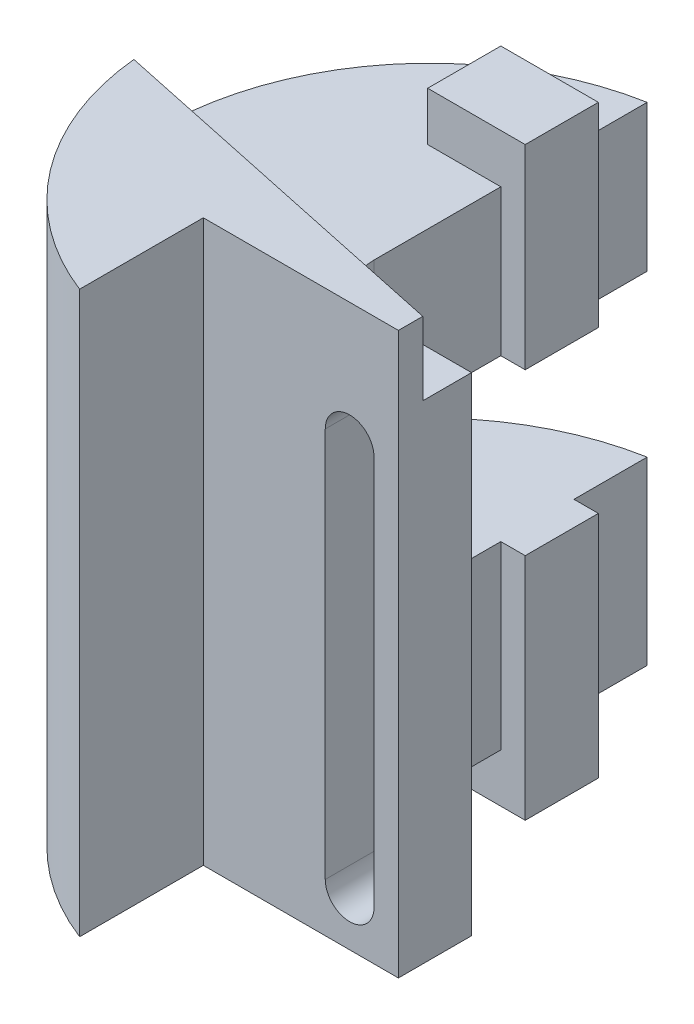
ISO-10303-21;
HEADER;
FILE_DESCRIPTION(('STEP AP214'),'2;1');
FILE_NAME('part.step','',(''),(''),'','','');
FILE_SCHEMA(('AUTOMOTIVE_DESIGN { 1 0 10303 214 1 1 1 1 }'));
ENDSEC;
DATA;
#1=APPLICATION_CONTEXT('core data for automotive mechanical design processes');
#2=APPLICATION_PROTOCOL_DEFINITION('international standard','automotive_design',2000,#1);
#3=PRODUCT_CONTEXT('',#1,'mechanical');
#4=PRODUCT('Part','Part','',(#3));
#5=PRODUCT_RELATED_PRODUCT_CATEGORY('part','',(#4));
#6=PRODUCT_DEFINITION_FORMATION('','',#4);
#7=PRODUCT_DEFINITION_CONTEXT('part definition',#1,'design');
#8=PRODUCT_DEFINITION('design','',#6,#7);
#9=PRODUCT_DEFINITION_SHAPE('','',#8);
#10=(LENGTH_UNIT() NAMED_UNIT(*) SI_UNIT(.MILLI.,.METRE.));
#11=(NAMED_UNIT(*) PLANE_ANGLE_UNIT() SI_UNIT($,.RADIAN.));
#12=(NAMED_UNIT(*) SI_UNIT($,.STERADIAN.) SOLID_ANGLE_UNIT());
#13=UNCERTAINTY_MEASURE_WITH_UNIT(LENGTH_MEASURE(1.E-05),#10,'distance_accuracy_value','');
#14=(GEOMETRIC_REPRESENTATION_CONTEXT(3) GLOBAL_UNCERTAINTY_ASSIGNED_CONTEXT((#13)) GLOBAL_UNIT_ASSIGNED_CONTEXT((#10,
#11,#12)) REPRESENTATION_CONTEXT('',''));
#15=CARTESIAN_POINT('',(0.,0.,0.));
#16=DIRECTION('',(0.,0.,1.));
#17=DIRECTION('',(1.,0.,0.));
#18=AXIS2_PLACEMENT_3D('',#15,#16,#17);
#19=CARTESIAN_POINT('',(-30.,100.,-25.));
#20=DIRECTION('',(-1.,0.,0.));
#21=DIRECTION('',(0.,0.,1.));
#22=AXIS2_PLACEMENT_3D('',#19,#20,#21);
#23=PLANE('',#22);
#24=DIRECTION('',(0.,-1.,0.));
#25=VECTOR('',#24,1.);
#26=CARTESIAN_POINT('',(-30.,100.,-81.));
#27=LINE('',#26,#25);
#28=CARTESIAN_POINT('',(-30.,37.,-81.));
#29=VERTEX_POINT('',#28);
#30=CARTESIAN_POINT('',(-30.,0.,-81.));
#31=VERTEX_POINT('',#30);
#32=EDGE_CURVE('E390',#29,#31,#27,.T.);
#33=ORIENTED_EDGE('',*,*,#32,.F.);
#34=DIRECTION('',(0.,0.,1.));
#35=VECTOR('',#34,1.);
#36=CARTESIAN_POINT('',(-30.,37.,-25.));
#37=LINE('',#36,#35);
#38=CARTESIAN_POINT('',(-30.,37.,-66.));
#39=VERTEX_POINT('',#38);
#40=EDGE_CURVE('E271',#29,#39,#37,.T.);
#41=ORIENTED_EDGE('',*,*,#40,.T.);
#42=DIRECTION('',(0.,1.,0.));
#43=VECTOR('',#42,1.);
#44=CARTESIAN_POINT('',(-30.,100.,-66.));
#45=LINE('',#44,#43);
#46=CARTESIAN_POINT('',(-30.,0.,-66.));
#47=VERTEX_POINT('',#46);
#48=EDGE_CURVE('E326',#47,#39,#45,.T.);
#49=ORIENTED_EDGE('',*,*,#48,.F.);
#50=DIRECTION('',(0.,0.,-1.));
#51=VECTOR('',#50,1.);
#52=CARTESIAN_POINT('',(-30.,0.,-25.));
#53=LINE('',#52,#51);
#54=EDGE_CURVE('E378',#47,#31,#53,.T.);
#55=ORIENTED_EDGE('',*,*,#54,.T.);
#56=EDGE_LOOP('',(#33,#41,#49,#55));
#57=FACE_BOUND('',#56,.T.);
#58=ADVANCED_FACE('F37',(#57),#23,.F.);
#59=CARTESIAN_POINT('',(-25.,110.,-66.));
#60=DIRECTION('',(-1.,0.,0.));
#61=DIRECTION('',(0.,0.,1.));
#62=AXIS2_PLACEMENT_3D('',#59,#60,#61);
#63=PLANE('',#62);
#64=DIRECTION('',(0.,-1.,0.));
#65=VECTOR('',#64,1.);
#66=CARTESIAN_POINT('',(-25.,110.,-66.));
#67=LINE('',#66,#65);
#68=CARTESIAN_POINT('',(-25.,37.,-66.));
#69=VERTEX_POINT('',#68);
#70=CARTESIAN_POINT('',(-25.,-9.99999999999999,-66.));
#71=VERTEX_POINT('',#70);
#72=EDGE_CURVE('E313',#69,#71,#67,.T.);
#73=ORIENTED_EDGE('',*,*,#72,.F.);
#74=DIRECTION('',(0.,0.,1.));
#75=VECTOR('',#74,1.);
#76=CARTESIAN_POINT('',(-25.,37.,-66.));
#77=LINE('',#76,#75);
#78=CARTESIAN_POINT('',(-25.,37.,-51.));
#79=VERTEX_POINT('',#78);
#80=EDGE_CURVE('E262',#69,#79,#77,.T.);
#81=ORIENTED_EDGE('',*,*,#80,.T.);
#82=DIRECTION('',(0.,-1.,0.));
#83=VECTOR('',#82,1.);
#84=CARTESIAN_POINT('',(-25.,110.,-51.));
#85=LINE('',#84,#83);
#86=CARTESIAN_POINT('',(-25.,-9.99999999999999,-51.));
#87=VERTEX_POINT('',#86);
#88=EDGE_CURVE('E291',#79,#87,#85,.T.);
#89=ORIENTED_EDGE('',*,*,#88,.T.);
#90=DIRECTION('',(0.,0.,-1.));
#91=VECTOR('',#90,1.);
#92=CARTESIAN_POINT('',(-25.,-9.99999999999999,-66.));
#93=LINE('',#92,#91);
#94=EDGE_CURVE('E280',#87,#71,#93,.T.);
#95=ORIENTED_EDGE('',*,*,#94,.T.);
#96=EDGE_LOOP('',(#73,#81,#89,#95));
#97=FACE_BOUND('',#96,.T.);
#98=ADVANCED_FACE('F451',(#97),#63,.F.);
#99=CARTESIAN_POINT('',(-25.,110.,-66.));
#100=DIRECTION('',(0.,0.,1.));
#101=DIRECTION('',(1.,0.,0.));
#102=AXIS2_PLACEMENT_3D('',#99,#100,#101);
#103=PLANE('',#102);
#104=ORIENTED_EDGE('',*,*,#48,.T.);
#105=DIRECTION('',(1.,0.,0.));
#106=VECTOR('',#105,1.);
#107=CARTESIAN_POINT('',(-25.,37.,-66.));
#108=LINE('',#107,#106);
#109=EDGE_CURVE('E268',#39,#69,#108,.T.);
#110=ORIENTED_EDGE('',*,*,#109,.T.);
#111=ORIENTED_EDGE('',*,*,#72,.T.);
#112=DIRECTION('',(-1.,0.,0.));
#113=VECTOR('',#112,1.);
#114=CARTESIAN_POINT('',(-25.,-9.99999999999999,-66.));
#115=LINE('',#114,#113);
#116=CARTESIAN_POINT('',(-45.,-9.99999999999999,-66.));
#117=VERTEX_POINT('',#116);
#118=EDGE_CURVE('E294',#71,#117,#115,.T.);
#119=ORIENTED_EDGE('',*,*,#118,.T.);
#120=DIRECTION('',(0.,-1.,0.));
#121=VECTOR('',#120,1.);
#122=CARTESIAN_POINT('',(-45.,110.,-66.));
#123=LINE('',#122,#121);
#124=CARTESIAN_POINT('',(-45.,0.,-66.));
#125=VERTEX_POINT('',#124);
#126=EDGE_CURVE('E309',#125,#117,#123,.T.);
#127=ORIENTED_EDGE('',*,*,#126,.F.);
#128=DIRECTION('',(1.,0.,0.));
#129=VECTOR('',#128,1.);
#130=CARTESIAN_POINT('',(-20.,0.,-66.));
#131=LINE('',#130,#129);
#132=EDGE_CURVE('E412',#125,#47,#131,.T.);
#133=ORIENTED_EDGE('',*,*,#132,.T.);
#134=EDGE_LOOP('',(#104,#110,#111,#119,#127,#133));
#135=FACE_BOUND('',#134,.T.);
#136=ADVANCED_FACE('F459',(#135),#103,.F.);
#137=CARTESIAN_POINT('',(-25.,110.,-51.));
#138=DIRECTION('',(0.,0.,-1.));
#139=DIRECTION('',(-1.,0.,0.));
#140=AXIS2_PLACEMENT_3D('',#137,#138,#139);
#141=PLANE('',#140);
#142=ORIENTED_EDGE('',*,*,#88,.F.);
#143=DIRECTION('',(-1.,0.,0.));
#144=VECTOR('',#143,1.);
#145=CARTESIAN_POINT('',(-25.,37.,-51.));
#146=LINE('',#145,#144);
#147=CARTESIAN_POINT('',(-30.,37.,-51.));
#148=VERTEX_POINT('',#147);
#149=EDGE_CURVE('E418',#79,#148,#146,.T.);
#150=ORIENTED_EDGE('',*,*,#149,.T.);
#151=DIRECTION('',(0.,-1.,0.));
#152=VECTOR('',#151,1.);
#153=CARTESIAN_POINT('',(-30.,100.,-51.));
#154=LINE('',#153,#152);
#155=CARTESIAN_POINT('',(-30.,0.,-51.));
#156=VERTEX_POINT('',#155);
#157=EDGE_CURVE('E317',#148,#156,#154,.T.);
#158=ORIENTED_EDGE('',*,*,#157,.T.);
#159=DIRECTION('',(-1.,0.,0.));
#160=VECTOR('',#159,1.);
#161=CARTESIAN_POINT('',(-20.,0.,-51.));
#162=LINE('',#161,#160);
#163=CARTESIAN_POINT('',(-45.,0.,-51.));
#164=VERTEX_POINT('',#163);
#165=EDGE_CURVE('E406',#156,#164,#162,.T.);
#166=ORIENTED_EDGE('',*,*,#165,.T.);
#167=DIRECTION('',(0.,-1.,0.));
#168=VECTOR('',#167,1.);
#169=CARTESIAN_POINT('',(-45.,110.,-51.));
#170=LINE('',#169,#168);
#171=CARTESIAN_POINT('',(-45.,-9.99999999999999,-51.));
#172=VERTEX_POINT('',#171);
#173=EDGE_CURVE('E305',#164,#172,#170,.T.);
#174=ORIENTED_EDGE('',*,*,#173,.T.);
#175=DIRECTION('',(1.,0.,0.));
#176=VECTOR('',#175,1.);
#177=CARTESIAN_POINT('',(-25.,-9.99999999999999,-51.));
#178=LINE('',#177,#176);
#179=EDGE_CURVE('E285',#172,#87,#178,.T.);
#180=ORIENTED_EDGE('',*,*,#179,.T.);
#181=EDGE_LOOP('',(#142,#150,#158,#166,#174,#180));
#182=FACE_BOUND('',#181,.T.);
#183=ADVANCED_FACE('F470',(#182),#141,.F.);
#184=CARTESIAN_POINT('',(-30.,70.,-66.));
#185=VERTEX_POINT('',#184);
#186=CARTESIAN_POINT('',(-30.,100.,-66.));
#187=VERTEX_POINT('',#186);
#188=EDGE_CURVE('E325',#185,#187,#45,.T.);
#189=ORIENTED_EDGE('',*,*,#188,.F.);
#190=DIRECTION('',(0.,0.,-1.));
#191=VECTOR('',#190,1.);
#192=CARTESIAN_POINT('',(-30.,70.,-25.));
#193=LINE('',#192,#191);
#194=CARTESIAN_POINT('',(-30.,70.,-81.));
#195=VERTEX_POINT('',#194);
#196=EDGE_CURVE('E256',#185,#195,#193,.T.);
#197=ORIENTED_EDGE('',*,*,#196,.T.);
#198=CARTESIAN_POINT('',(-30.,100.,-81.));
#199=VERTEX_POINT('',#198);
#200=EDGE_CURVE('E391',#199,#195,#27,.T.);
#201=ORIENTED_EDGE('',*,*,#200,.F.);
#202=DIRECTION('',(0.,0.,-1.));
#203=VECTOR('',#202,1.);
#204=CARTESIAN_POINT('',(-30.,100.,-25.));
#205=LINE('',#204,#203);
#206=EDGE_CURVE('E363',#187,#199,#205,.T.);
#207=ORIENTED_EDGE('',*,*,#206,.F.);
#208=EDGE_LOOP('',(#189,#197,#201,#207));
#209=FACE_BOUND('',#208,.T.);
#210=ADVANCED_FACE('F455',(#209),#23,.F.);
#211=ORIENTED_EDGE('',*,*,#157,.F.);
#212=DIRECTION('',(0.,0.,1.));
#213=VECTOR('',#212,1.);
#214=CARTESIAN_POINT('',(-30.,37.,-25.));
#215=LINE('',#214,#213);
#216=CARTESIAN_POINT('',(-30.,37.,-41.));
#217=VERTEX_POINT('',#216);
#218=EDGE_CURVE('E265',#148,#217,#215,.T.);
#219=ORIENTED_EDGE('',*,*,#218,.T.);
#220=DIRECTION('',(0.,1.,0.));
#221=VECTOR('',#220,1.);
#222=CARTESIAN_POINT('',(-30.,100.,-41.));
#223=LINE('',#222,#221);
#224=CARTESIAN_POINT('',(-30.,70.,-41.));
#225=VERTEX_POINT('',#224);
#226=EDGE_CURVE('E277',#217,#225,#223,.T.);
#227=ORIENTED_EDGE('',*,*,#226,.T.);
#228=DIRECTION('',(0.,0.,-1.));
#229=VECTOR('',#228,1.);
#230=CARTESIAN_POINT('',(-30.,70.,-25.));
#231=LINE('',#230,#229);
#232=CARTESIAN_POINT('',(-30.,70.,-51.));
#233=VERTEX_POINT('',#232);
#234=EDGE_CURVE('E250',#225,#233,#231,.T.);
#235=ORIENTED_EDGE('',*,*,#234,.T.);
#236=CARTESIAN_POINT('',(-30.,100.,-51.));
#237=VERTEX_POINT('',#236);
#238=EDGE_CURVE('E318',#237,#233,#154,.T.);
#239=ORIENTED_EDGE('',*,*,#238,.F.);
#240=CARTESIAN_POINT('',(-30.,100.,-25.));
#241=VERTEX_POINT('',#240);
#242=EDGE_CURVE('E364',#241,#237,#205,.T.);
#243=ORIENTED_EDGE('',*,*,#242,.F.);
#244=DIRECTION('',(0.,-1.,0.));
#245=VECTOR('',#244,1.);
#246=CARTESIAN_POINT('',(-30.,100.,-25.));
#247=LINE('',#246,#245);
#248=CARTESIAN_POINT('',(-30.,0.,-25.));
#249=VERTEX_POINT('',#248);
#250=EDGE_CURVE('E394',#241,#249,#247,.T.);
#251=ORIENTED_EDGE('',*,*,#250,.T.);
#252=EDGE_CURVE('E379',#249,#156,#53,.T.);
#253=ORIENTED_EDGE('',*,*,#252,.T.);
#254=EDGE_LOOP('',(#211,#219,#227,#235,#239,#243,#251,#253));
#255=FACE_BOUND('',#254,.T.);
#256=ADVANCED_FACE('F454',(#255),#23,.F.);
#257=CARTESIAN_POINT('',(-20.,100.,-26.4083339693685));
#258=DIRECTION('',(0.,1.,0.));
#259=DIRECTION('',(0.,0.,1.));
#260=AXIS2_PLACEMENT_3D('',#257,#258,#259);
#261=PLANE('',#260);
#262=DIRECTION('',(0.,0.,-1.));
#263=VECTOR('',#262,1.);
#264=CARTESIAN_POINT('',(-45.,100.,-26.4083339693685));
#265=LINE('',#264,#263);
#266=CARTESIAN_POINT('',(-45.,100.,-51.));
#267=VERTEX_POINT('',#266);
#268=CARTESIAN_POINT('',(-45.,100.,-66.));
#269=VERTEX_POINT('',#268);
#270=EDGE_CURVE('E323',#267,#269,#265,.T.);
#271=ORIENTED_EDGE('',*,*,#270,.T.);
#272=DIRECTION('',(1.,0.,0.));
#273=VECTOR('',#272,1.);
#274=CARTESIAN_POINT('',(-20.,100.,-66.));
#275=LINE('',#274,#273);
#276=EDGE_CURVE('E329',#269,#187,#275,.T.);
#277=ORIENTED_EDGE('',*,*,#276,.T.);
#278=ORIENTED_EDGE('',*,*,#206,.T.);
#279=CARTESIAN_POINT('',(-20.,100.,-26.4083339693685));
#280=DIRECTION('',(0.,1.,0.));
#281=DIRECTION('',(0.,0.,1.));
#282=AXIS2_PLACEMENT_3D('',#279,#280,#281);
#283=CIRCLE('',#282,55.5);
#284=CARTESIAN_POINT('',(-75.2350441418964,100.,-20.9917022998936));
#285=VERTEX_POINT('',#284);
#286=EDGE_CURVE('E367',#199,#285,#283,.T.);
#287=ORIENTED_EDGE('',*,*,#286,.T.);
#288=DIRECTION('',(-0.978147600733806,0.,-0.207911690817756));
#289=VECTOR('',#288,1.);
#290=CARTESIAN_POINT('',(0.,100.,-4.99999999999999));
#291=LINE('',#290,#289);
#292=CARTESIAN_POINT('',(0.,100.,-4.99999999999999));
#293=VERTEX_POINT('',#292);
#294=EDGE_CURVE('E332',#293,#285,#291,.T.);
#295=ORIENTED_EDGE('',*,*,#294,.F.);
#296=DIRECTION('',(0.,0.,-1.));
#297=VECTOR('',#296,1.);
#298=CARTESIAN_POINT('',(0.,100.,0.));
#299=LINE('',#298,#297);
#300=CARTESIAN_POINT('',(0.,100.,-15.));
#301=VERTEX_POINT('',#300);
#302=EDGE_CURVE('E356',#293,#301,#299,.T.);
#303=ORIENTED_EDGE('',*,*,#302,.T.);
#304=DIRECTION('',(-1.,0.,0.));
#305=VECTOR('',#304,1.);
#306=CARTESIAN_POINT('',(0.,100.,-15.));
#307=LINE('',#306,#305);
#308=CARTESIAN_POINT('',(-20.,100.,-15.));
#309=VERTEX_POINT('',#308);
#310=EDGE_CURVE('E358',#301,#309,#307,.T.);
#311=ORIENTED_EDGE('',*,*,#310,.T.);
#312=CARTESIAN_POINT('',(-20.,100.,-25.));
#313=DIRECTION('',(0.,-1.,0.));
#314=DIRECTION('',(0.,0.,-1.));
#315=AXIS2_PLACEMENT_3D('',#312,#313,#314);
#316=CIRCLE('',#315,10.);
#317=EDGE_CURVE('E361',#309,#241,#316,.T.);
#318=ORIENTED_EDGE('',*,*,#317,.T.);
#319=ORIENTED_EDGE('',*,*,#242,.T.);
#320=DIRECTION('',(-1.,0.,0.));
#321=VECTOR('',#320,1.);
#322=CARTESIAN_POINT('',(-20.,100.,-51.));
#323=LINE('',#322,#321);
#324=EDGE_CURVE('E321',#237,#267,#323,.T.);
#325=ORIENTED_EDGE('',*,*,#324,.T.);
#326=EDGE_LOOP('',(#271,#277,#278,#287,#295,#303,#311,#318,#319,#325));
#327=FACE_BOUND('',#326,.T.);
#328=ADVANCED_FACE('F467',(#327),#261,.T.);
#329=CARTESIAN_POINT('',(-20.,0.,-26.4083339693685));
#330=DIRECTION('',(0.,1.,0.));
#331=DIRECTION('',(0.,0.,1.));
#332=AXIS2_PLACEMENT_3D('',#329,#330,#331);
#333=PLANE('',#332);
#334=ORIENTED_EDGE('',*,*,#132,.F.);
#335=DIRECTION('',(0.,0.,-1.));
#336=VECTOR('',#335,1.);
#337=CARTESIAN_POINT('',(-45.,0.,-26.4083339693685));
#338=LINE('',#337,#336);
#339=EDGE_CURVE('E409',#164,#125,#338,.T.);
#340=ORIENTED_EDGE('',*,*,#339,.F.);
#341=ORIENTED_EDGE('',*,*,#165,.F.);
#342=ORIENTED_EDGE('',*,*,#252,.F.);
#343=CARTESIAN_POINT('',(-20.,0.,-25.));
#344=DIRECTION('',(0.,-1.,0.));
#345=DIRECTION('',(0.,0.,-1.));
#346=AXIS2_PLACEMENT_3D('',#343,#344,#345);
#347=CIRCLE('',#346,10.);
#348=CARTESIAN_POINT('',(-20.,0.,-15.));
#349=VERTEX_POINT('',#348);
#350=EDGE_CURVE('E376',#349,#249,#347,.T.);
#351=ORIENTED_EDGE('',*,*,#350,.F.);
#352=DIRECTION('',(-1.,0.,0.));
#353=VECTOR('',#352,1.);
#354=CARTESIAN_POINT('',(0.,0.,-15.));
#355=LINE('',#354,#353);
#356=CARTESIAN_POINT('',(0.,0.,-15.));
#357=VERTEX_POINT('',#356);
#358=EDGE_CURVE('E374',#357,#349,#355,.T.);
#359=ORIENTED_EDGE('',*,*,#358,.F.);
#360=DIRECTION('',(0.,0.,-1.));
#361=VECTOR('',#360,1.);
#362=CARTESIAN_POINT('',(0.,0.,0.));
#363=LINE('',#362,#361);
#364=CARTESIAN_POINT('',(0.,0.,0.));
#365=VERTEX_POINT('',#364);
#366=EDGE_CURVE('E372',#365,#357,#363,.T.);
#367=ORIENTED_EDGE('',*,*,#366,.F.);
#368=DIRECTION('',(1.,0.,0.));
#369=VECTOR('',#368,1.);
#370=CARTESIAN_POINT('',(0.,0.,0.));
#371=LINE('',#370,#369);
#372=CARTESIAN_POINT('',(-40.,0.,0.));
#373=VERTEX_POINT('',#372);
#374=EDGE_CURVE('E355',#373,#365,#371,.T.);
#375=ORIENTED_EDGE('',*,*,#374,.F.);
#376=DIRECTION('',(0.,0.,-1.));
#377=VECTOR('',#376,1.);
#378=CARTESIAN_POINT('',(-40.,0.,0.));
#379=LINE('',#378,#377);
#380=CARTESIAN_POINT('',(-40.,0.,25.3627969821569));
#381=VERTEX_POINT('',#380);
#382=EDGE_CURVE('E359',#381,#373,#379,.T.);
#383=ORIENTED_EDGE('',*,*,#382,.F.);
#384=CARTESIAN_POINT('',(-20.,0.,-26.4083339693685));
#385=DIRECTION('',(0.,1.,0.));
#386=DIRECTION('',(0.,0.,1.));
#387=AXIS2_PLACEMENT_3D('',#384,#385,#386);
#388=CIRCLE('',#387,55.5);
#389=EDGE_CURVE('E382',#31,#381,#388,.T.);
#390=ORIENTED_EDGE('',*,*,#389,.F.);
#391=ORIENTED_EDGE('',*,*,#54,.F.);
#392=EDGE_LOOP('',(#334,#340,#341,#342,#351,#359,#367,#375,#383,#390,#391));
#393=FACE_BOUND('',#392,.T.);
#394=ADVANCED_FACE('F514',(#393),#333,.F.);
#395=CARTESIAN_POINT('',(0.,100.,0.));
#396=DIRECTION('',(0.,0.,-1.));
#397=DIRECTION('',(-1.,0.,0.));
#398=AXIS2_PLACEMENT_3D('',#395,#396,#397);
#399=PLANE('',#398);
#400=DIRECTION('',(0.,1.,0.));
#401=VECTOR('',#400,1.);
#402=CARTESIAN_POINT('',(-15.,100.,0.));
#403=LINE('',#402,#401);
#404=CARTESIAN_POINT('',(-15.,10.,0.));
#405=VERTEX_POINT('',#404);
#406=CARTESIAN_POINT('',(-15.,90.,0.));
#407=VERTEX_POINT('',#406);
#408=EDGE_CURVE('E236',#405,#407,#403,.T.);
#409=ORIENTED_EDGE('',*,*,#408,.T.);
#410=CARTESIAN_POINT('',(-10.,90.,0.));
#411=DIRECTION('',(0.,0.,-1.));
#412=DIRECTION('',(-1.,0.,0.));
#413=AXIS2_PLACEMENT_3D('',#410,#411,#412);
#414=CIRCLE('',#413,5.);
#415=CARTESIAN_POINT('',(-5.,90.,0.));
#416=VERTEX_POINT('',#415);
#417=EDGE_CURVE('E230',#407,#416,#414,.T.);
#418=ORIENTED_EDGE('',*,*,#417,.T.);
#419=DIRECTION('',(0.,-1.,0.));
#420=VECTOR('',#419,1.);
#421=CARTESIAN_POINT('',(-5.,100.,0.));
#422=LINE('',#421,#420);
#423=CARTESIAN_POINT('',(-5.00000000000001,9.99999999999999,0.));
#424=VERTEX_POINT('',#423);
#425=EDGE_CURVE('E219',#416,#424,#422,.T.);
#426=ORIENTED_EDGE('',*,*,#425,.T.);
#427=CARTESIAN_POINT('',(-10.,10.,0.));
#428=DIRECTION('',(0.,0.,-1.));
#429=DIRECTION('',(-1.,0.,0.));
#430=AXIS2_PLACEMENT_3D('',#427,#428,#429);
#431=CIRCLE('',#430,5.);
#432=EDGE_CURVE('E224',#424,#405,#431,.T.);
#433=ORIENTED_EDGE('',*,*,#432,.T.);
#434=EDGE_LOOP('',(#409,#418,#426,#433));
#435=FACE_BOUND('',#434,.T.);
#436=ORIENTED_EDGE('',*,*,#374,.T.);
#437=DIRECTION('',(0.,-1.,0.));
#438=VECTOR('',#437,1.);
#439=CARTESIAN_POINT('',(0.,100.,0.));
#440=LINE('',#439,#438);
#441=CARTESIAN_POINT('',(0.,115.,0.));
#442=VERTEX_POINT('',#441);
#443=EDGE_CURVE('E403',#442,#365,#440,.T.);
#444=ORIENTED_EDGE('',*,*,#443,.F.);
#445=DIRECTION('',(1.,0.,0.));
#446=VECTOR('',#445,1.);
#447=CARTESIAN_POINT('',(-40.,115.,0.));
#448=LINE('',#447,#446);
#449=CARTESIAN_POINT('',(-40.,115.,0.));
#450=VERTEX_POINT('',#449);
#451=EDGE_CURVE('E344',#450,#442,#448,.T.);
#452=ORIENTED_EDGE('',*,*,#451,.F.);
#453=DIRECTION('',(0.,-1.,0.));
#454=VECTOR('',#453,1.);
#455=CARTESIAN_POINT('',(-40.,100.,0.));
#456=LINE('',#455,#454);
#457=EDGE_CURVE('E369',#450,#373,#456,.T.);
#458=ORIENTED_EDGE('',*,*,#457,.T.);
#459=EDGE_LOOP('',(#436,#444,#452,#458));
#460=FACE_BOUND('',#459,.T.);
#461=ADVANCED_FACE('F39',(#435,#460),#399,.F.);
#462=CARTESIAN_POINT('',(0.,100.,0.));
#463=DIRECTION('',(-1.,0.,0.));
#464=DIRECTION('',(0.,0.,1.));
#465=AXIS2_PLACEMENT_3D('',#462,#463,#464);
#466=PLANE('',#465);
#467=ORIENTED_EDGE('',*,*,#366,.T.);
#468=DIRECTION('',(0.,-1.,0.));
#469=VECTOR('',#468,1.);
#470=CARTESIAN_POINT('',(0.,100.,-15.));
#471=LINE('',#470,#469);
#472=EDGE_CURVE('E400',#301,#357,#471,.T.);
#473=ORIENTED_EDGE('',*,*,#472,.F.);
#474=ORIENTED_EDGE('',*,*,#302,.F.);
#475=DIRECTION('',(0.,-1.,0.));
#476=VECTOR('',#475,1.);
#477=CARTESIAN_POINT('',(0.,115.,-4.99999999999999));
#478=LINE('',#477,#476);
#479=CARTESIAN_POINT('',(0.,115.,-4.99999999999999));
#480=VERTEX_POINT('',#479);
#481=EDGE_CURVE('E352',#480,#293,#478,.T.);
#482=ORIENTED_EDGE('',*,*,#481,.F.);
#483=DIRECTION('',(0.,0.,-1.));
#484=VECTOR('',#483,1.);
#485=CARTESIAN_POINT('',(0.,115.,0.));
#486=LINE('',#485,#484);
#487=EDGE_CURVE('E333',#442,#480,#486,.T.);
#488=ORIENTED_EDGE('',*,*,#487,.F.);
#489=ORIENTED_EDGE('',*,*,#443,.T.);
#490=EDGE_LOOP('',(#467,#473,#474,#482,#488,#489));
#491=FACE_BOUND('',#490,.T.);
#492=ADVANCED_FACE('F547',(#491),#466,.F.);
#493=CARTESIAN_POINT('',(0.,100.,-15.));
#494=DIRECTION('',(0.,0.,1.));
#495=DIRECTION('',(1.,0.,0.));
#496=AXIS2_PLACEMENT_3D('',#493,#494,#495);
#497=PLANE('',#496);
#498=DIRECTION('',(0.,1.,0.));
#499=VECTOR('',#498,1.);
#500=CARTESIAN_POINT('',(-5.,100.,-15.));
#501=LINE('',#500,#499);
#502=CARTESIAN_POINT('',(-5.00000000000001,10.,-15.));
#503=VERTEX_POINT('',#502);
#504=CARTESIAN_POINT('',(-5.,90.,-15.));
#505=VERTEX_POINT('',#504);
#506=EDGE_CURVE('E424',#503,#505,#501,.T.);
#507=ORIENTED_EDGE('',*,*,#506,.T.);
#508=CARTESIAN_POINT('',(-10.,90.,-15.));
#509=DIRECTION('',(0.,0.,1.));
#510=DIRECTION('',(1.,0.,0.));
#511=AXIS2_PLACEMENT_3D('',#508,#509,#510);
#512=CIRCLE('',#511,5.);
#513=CARTESIAN_POINT('',(-15.,90.,-15.));
#514=VERTEX_POINT('',#513);
#515=EDGE_CURVE('E11',#505,#514,#512,.T.);
#516=ORIENTED_EDGE('',*,*,#515,.T.);
#517=DIRECTION('',(0.,-1.,0.));
#518=VECTOR('',#517,1.);
#519=CARTESIAN_POINT('',(-15.,100.,-15.));
#520=LINE('',#519,#518);
#521=CARTESIAN_POINT('',(-15.,10.,-15.));
#522=VERTEX_POINT('',#521);
#523=EDGE_CURVE('E45',#514,#522,#520,.T.);
#524=ORIENTED_EDGE('',*,*,#523,.T.);
#525=CARTESIAN_POINT('',(-10.,10.,-15.));
#526=DIRECTION('',(0.,0.,1.));
#527=DIRECTION('',(1.,0.,0.));
#528=AXIS2_PLACEMENT_3D('',#525,#526,#527);
#529=CIRCLE('',#528,5.);
#530=EDGE_CURVE('E426',#522,#503,#529,.T.);
#531=ORIENTED_EDGE('',*,*,#530,.T.);
#532=EDGE_LOOP('',(#507,#516,#524,#531));
#533=FACE_BOUND('',#532,.T.);
#534=ORIENTED_EDGE('',*,*,#358,.T.);
#535=DIRECTION('',(0.,-1.,0.));
#536=VECTOR('',#535,1.);
#537=CARTESIAN_POINT('',(-20.,100.,-15.));
#538=LINE('',#537,#536);
#539=EDGE_CURVE('E397',#309,#349,#538,.T.);
#540=ORIENTED_EDGE('',*,*,#539,.F.);
#541=ORIENTED_EDGE('',*,*,#310,.F.);
#542=ORIENTED_EDGE('',*,*,#472,.T.);
#543=EDGE_LOOP('',(#534,#540,#541,#542));
#544=FACE_BOUND('',#543,.T.);
#545=ADVANCED_FACE('F430',(#533,#544),#497,.F.);
#546=CARTESIAN_POINT('',(-20.,100.,-25.));
#547=DIRECTION('',(0.,-1.,0.));
#548=DIRECTION('',(0.,0.,-1.));
#549=AXIS2_PLACEMENT_3D('',#546,#547,#548);
#550=CYLINDRICAL_SURFACE('',#549,10.);
#551=ORIENTED_EDGE('',*,*,#350,.T.);
#552=ORIENTED_EDGE('',*,*,#250,.F.);
#553=ORIENTED_EDGE('',*,*,#317,.F.);
#554=ORIENTED_EDGE('',*,*,#539,.T.);
#555=EDGE_LOOP('',(#551,#552,#553,#554));
#556=FACE_BOUND('',#555,.T.);
#557=ADVANCED_FACE('F509',(#556),#550,.F.);
#558=CARTESIAN_POINT('',(-20.,100.,-26.4083339693685));
#559=DIRECTION('',(0.,-1.,0.));
#560=DIRECTION('',(0.,0.,-1.));
#561=AXIS2_PLACEMENT_3D('',#558,#559,#560);
#562=CYLINDRICAL_SURFACE('',#561,55.5);
#563=DIRECTION('',(0.,-1.,0.));
#564=VECTOR('',#563,1.);
#565=CARTESIAN_POINT('',(-73.5474862383895,100.,-41.));
#566=LINE('',#565,#564);
#567=CARTESIAN_POINT('',(-73.5474862383895,70.,-41.));
#568=VERTEX_POINT('',#567);
#569=CARTESIAN_POINT('',(-73.5474862383895,37.,-41.));
#570=VERTEX_POINT('',#569);
#571=EDGE_CURVE('E421',#568,#570,#566,.T.);
#572=ORIENTED_EDGE('',*,*,#571,.T.);
#573=CARTESIAN_POINT('',(-20.,37.,-26.4083339693685));
#574=DIRECTION('',(0.,-1.,0.));
#575=DIRECTION('',(0.,0.,-1.));
#576=AXIS2_PLACEMENT_3D('',#573,#574,#575);
#577=CIRCLE('',#576,55.5);
#578=EDGE_CURVE('E274',#570,#29,#577,.T.);
#579=ORIENTED_EDGE('',*,*,#578,.T.);
#580=ORIENTED_EDGE('',*,*,#32,.T.);
#581=ORIENTED_EDGE('',*,*,#389,.T.);
#582=DIRECTION('',(0.,-1.,0.));
#583=VECTOR('',#582,1.);
#584=CARTESIAN_POINT('',(-40.,100.,25.3627969821569));
#585=LINE('',#584,#583);
#586=CARTESIAN_POINT('',(-40.,115.,25.3627969821569));
#587=VERTEX_POINT('',#586);
#588=EDGE_CURVE('E387',#587,#381,#585,.T.);
#589=ORIENTED_EDGE('',*,*,#588,.F.);
#590=CARTESIAN_POINT('',(-20.,115.,-26.4083339693685));
#591=DIRECTION('',(0.,1.,0.));
#592=DIRECTION('',(0.,0.,1.));
#593=AXIS2_PLACEMENT_3D('',#590,#591,#592);
#594=CIRCLE('',#593,55.5);
#595=CARTESIAN_POINT('',(-75.2350441418964,115.,-20.9917022998936));
#596=VERTEX_POINT('',#595);
#597=EDGE_CURVE('E338',#596,#587,#594,.T.);
#598=ORIENTED_EDGE('',*,*,#597,.F.);
#599=DIRECTION('',(0.,-1.,0.));
#600=VECTOR('',#599,1.);
#601=CARTESIAN_POINT('',(-75.2350441418964,115.,-20.9917022998936));
#602=LINE('',#601,#600);
#603=EDGE_CURVE('E347',#596,#285,#602,.T.);
#604=ORIENTED_EDGE('',*,*,#603,.T.);
#605=ORIENTED_EDGE('',*,*,#286,.F.);
#606=ORIENTED_EDGE('',*,*,#200,.T.);
#607=CARTESIAN_POINT('',(-20.,70.,-26.4083339693685));
#608=DIRECTION('',(0.,1.,0.));
#609=DIRECTION('',(0.,0.,1.));
#610=AXIS2_PLACEMENT_3D('',#607,#608,#609);
#611=CIRCLE('',#610,55.5);
#612=EDGE_CURVE('E259',#195,#568,#611,.T.);
#613=ORIENTED_EDGE('',*,*,#612,.T.);
#614=EDGE_LOOP('',(#572,#579,#580,#581,#589,#598,#604,#605,#606,#613));
#615=FACE_BOUND('',#614,.T.);
#616=ADVANCED_FACE('F537',(#615),#562,.T.);
#617=CARTESIAN_POINT('',(-40.,100.,0.));
#618=DIRECTION('',(-1.,0.,0.));
#619=DIRECTION('',(0.,0.,1.));
#620=AXIS2_PLACEMENT_3D('',#617,#618,#619);
#621=PLANE('',#620);
#622=ORIENTED_EDGE('',*,*,#382,.T.);
#623=ORIENTED_EDGE('',*,*,#457,.F.);
#624=DIRECTION('',(0.,0.,-1.));
#625=VECTOR('',#624,1.);
#626=CARTESIAN_POINT('',(-40.,115.,25.3627969821569));
#627=LINE('',#626,#625);
#628=EDGE_CURVE('E341',#587,#450,#627,.T.);
#629=ORIENTED_EDGE('',*,*,#628,.F.);
#630=ORIENTED_EDGE('',*,*,#588,.T.);
#631=EDGE_LOOP('',(#622,#623,#629,#630));
#632=FACE_BOUND('',#631,.T.);
#633=ADVANCED_FACE('F541',(#632),#621,.F.);
#634=CARTESIAN_POINT('',(0.,115.,-4.99999999999999));
#635=DIRECTION('',(-0.207911690817756,0.,0.978147600733806));
#636=DIRECTION('',(0.978147600733806,0.,0.207911690817756));
#637=AXIS2_PLACEMENT_3D('',#634,#635,#636);
#638=PLANE('',#637);
#639=ORIENTED_EDGE('',*,*,#294,.T.);
#640=ORIENTED_EDGE('',*,*,#603,.F.);
#641=DIRECTION('',(-0.978147600733806,0.,-0.207911690817756));
#642=VECTOR('',#641,1.);
#643=CARTESIAN_POINT('',(0.,115.,-4.99999999999999));
#644=LINE('',#643,#642);
#645=EDGE_CURVE('E336',#480,#596,#644,.T.);
#646=ORIENTED_EDGE('',*,*,#645,.F.);
#647=ORIENTED_EDGE('',*,*,#481,.T.);
#648=EDGE_LOOP('',(#639,#640,#646,#647));
#649=FACE_BOUND('',#648,.T.);
#650=ADVANCED_FACE('F553',(#649),#638,.F.);
#651=CARTESIAN_POINT('',(-20.,115.,-26.4083339693685));
#652=DIRECTION('',(0.,1.,0.));
#653=DIRECTION('',(0.,0.,1.));
#654=AXIS2_PLACEMENT_3D('',#651,#652,#653);
#655=PLANE('',#654);
#656=ORIENTED_EDGE('',*,*,#487,.T.);
#657=ORIENTED_EDGE('',*,*,#645,.T.);
#658=ORIENTED_EDGE('',*,*,#597,.T.);
#659=ORIENTED_EDGE('',*,*,#628,.T.);
#660=ORIENTED_EDGE('',*,*,#451,.T.);
#661=EDGE_LOOP('',(#656,#657,#658,#659,#660));
#662=FACE_BOUND('',#661,.T.);
#663=ADVANCED_FACE('F544',(#662),#655,.T.);
#664=CARTESIAN_POINT('',(-45.,110.,-66.));
#665=DIRECTION('',(1.,0.,0.));
#666=DIRECTION('',(0.,0.,-1.));
#667=AXIS2_PLACEMENT_3D('',#664,#665,#666);
#668=PLANE('',#667);
#669=ORIENTED_EDGE('',*,*,#173,.F.);
#670=ORIENTED_EDGE('',*,*,#339,.T.);
#671=ORIENTED_EDGE('',*,*,#126,.T.);
#672=DIRECTION('',(0.,0.,1.));
#673=VECTOR('',#672,1.);
#674=CARTESIAN_POINT('',(-45.,-9.99999999999999,-66.));
#675=LINE('',#674,#673);
#676=EDGE_CURVE('E297',#117,#172,#675,.T.);
#677=ORIENTED_EDGE('',*,*,#676,.T.);
#678=EDGE_LOOP('',(#669,#670,#671,#677));
#679=FACE_BOUND('',#678,.T.);
#680=ADVANCED_FACE('F519',(#679),#668,.F.);
#681=CARTESIAN_POINT('',(-25.,110.,-51.));
#682=VERTEX_POINT('',#681);
#683=CARTESIAN_POINT('',(-25.,70.,-51.));
#684=VERTEX_POINT('',#683);
#685=EDGE_CURVE('E302',#682,#684,#85,.T.);
#686=ORIENTED_EDGE('',*,*,#685,.T.);
#687=DIRECTION('',(0.,0.,-1.));
#688=VECTOR('',#687,1.);
#689=CARTESIAN_POINT('',(-25.,70.,-66.));
#690=LINE('',#689,#688);
#691=CARTESIAN_POINT('',(-25.,70.,-66.));
#692=VERTEX_POINT('',#691);
#693=EDGE_CURVE('E246',#684,#692,#690,.T.);
#694=ORIENTED_EDGE('',*,*,#693,.T.);
#695=CARTESIAN_POINT('',(-25.,110.,-66.));
#696=VERTEX_POINT('',#695);
#697=EDGE_CURVE('E314',#696,#692,#67,.T.);
#698=ORIENTED_EDGE('',*,*,#697,.F.);
#699=DIRECTION('',(0.,0.,-1.));
#700=VECTOR('',#699,1.);
#701=CARTESIAN_POINT('',(-25.,110.,-66.));
#702=LINE('',#701,#700);
#703=EDGE_CURVE('E281',#682,#696,#702,.T.);
#704=ORIENTED_EDGE('',*,*,#703,.F.);
#705=EDGE_LOOP('',(#686,#694,#698,#704));
#706=FACE_BOUND('',#705,.T.);
#707=ADVANCED_FACE('F462',(#706),#63,.F.);
#708=ORIENTED_EDGE('',*,*,#697,.T.);
#709=DIRECTION('',(-1.,0.,0.));
#710=VECTOR('',#709,1.);
#711=CARTESIAN_POINT('',(-25.,70.,-66.));
#712=LINE('',#711,#710);
#713=EDGE_CURVE('E253',#692,#185,#712,.T.);
#714=ORIENTED_EDGE('',*,*,#713,.T.);
#715=ORIENTED_EDGE('',*,*,#188,.T.);
#716=ORIENTED_EDGE('',*,*,#276,.F.);
#717=CARTESIAN_POINT('',(-45.,110.,-66.));
#718=VERTEX_POINT('',#717);
#719=EDGE_CURVE('E310',#718,#269,#123,.T.);
#720=ORIENTED_EDGE('',*,*,#719,.F.);
#721=DIRECTION('',(-1.,0.,0.));
#722=VECTOR('',#721,1.);
#723=CARTESIAN_POINT('',(-25.,110.,-66.));
#724=LINE('',#723,#722);
#725=EDGE_CURVE('E284',#696,#718,#724,.T.);
#726=ORIENTED_EDGE('',*,*,#725,.F.);
#727=EDGE_LOOP('',(#708,#714,#715,#716,#720,#726));
#728=FACE_BOUND('',#727,.T.);
#729=ADVANCED_FACE('F483',(#728),#103,.F.);
#730=ORIENTED_EDGE('',*,*,#270,.F.);
#731=CARTESIAN_POINT('',(-45.,110.,-51.));
#732=VERTEX_POINT('',#731);
#733=EDGE_CURVE('E306',#732,#267,#170,.T.);
#734=ORIENTED_EDGE('',*,*,#733,.F.);
#735=DIRECTION('',(0.,0.,1.));
#736=VECTOR('',#735,1.);
#737=CARTESIAN_POINT('',(-45.,110.,-66.));
#738=LINE('',#737,#736);
#739=EDGE_CURVE('E287',#718,#732,#738,.T.);
#740=ORIENTED_EDGE('',*,*,#739,.F.);
#741=ORIENTED_EDGE('',*,*,#719,.T.);
#742=EDGE_LOOP('',(#730,#734,#740,#741));
#743=FACE_BOUND('',#742,.T.);
#744=ADVANCED_FACE('F490',(#743),#668,.F.);
#745=ORIENTED_EDGE('',*,*,#238,.T.);
#746=DIRECTION('',(1.,0.,0.));
#747=VECTOR('',#746,1.);
#748=CARTESIAN_POINT('',(-25.,70.,-51.));
#749=LINE('',#748,#747);
#750=EDGE_CURVE('E415',#233,#684,#749,.T.);
#751=ORIENTED_EDGE('',*,*,#750,.T.);
#752=ORIENTED_EDGE('',*,*,#685,.F.);
#753=DIRECTION('',(1.,0.,0.));
#754=VECTOR('',#753,1.);
#755=CARTESIAN_POINT('',(-25.,110.,-51.));
#756=LINE('',#755,#754);
#757=EDGE_CURVE('E289',#732,#682,#756,.T.);
#758=ORIENTED_EDGE('',*,*,#757,.F.);
#759=ORIENTED_EDGE('',*,*,#733,.T.);
#760=ORIENTED_EDGE('',*,*,#324,.F.);
#761=EDGE_LOOP('',(#745,#751,#752,#758,#759,#760));
#762=FACE_BOUND('',#761,.T.);
#763=ADVANCED_FACE('F477',(#762),#141,.F.);
#764=CARTESIAN_POINT('',(0.,110.,0.));
#765=DIRECTION('',(0.,-1.,0.));
#766=DIRECTION('',(0.,0.,-1.));
#767=AXIS2_PLACEMENT_3D('',#764,#765,#766);
#768=PLANE('',#767);
#769=ORIENTED_EDGE('',*,*,#703,.T.);
#770=ORIENTED_EDGE('',*,*,#725,.T.);
#771=ORIENTED_EDGE('',*,*,#739,.T.);
#772=ORIENTED_EDGE('',*,*,#757,.T.);
#773=EDGE_LOOP('',(#769,#770,#771,#772));
#774=FACE_BOUND('',#773,.T.);
#775=ADVANCED_FACE('F497',(#774),#768,.F.);
#776=CARTESIAN_POINT('',(0.,-9.99999999999999,0.));
#777=DIRECTION('',(0.,-1.,0.));
#778=DIRECTION('',(0.,0.,-1.));
#779=AXIS2_PLACEMENT_3D('',#776,#777,#778);
#780=PLANE('',#779);
#781=ORIENTED_EDGE('',*,*,#94,.F.);
#782=ORIENTED_EDGE('',*,*,#179,.F.);
#783=ORIENTED_EDGE('',*,*,#676,.F.);
#784=ORIENTED_EDGE('',*,*,#118,.F.);
#785=EDGE_LOOP('',(#781,#782,#783,#784));
#786=FACE_BOUND('',#785,.T.);
#787=ADVANCED_FACE('F526',(#786),#780,.T.);
#788=CARTESIAN_POINT('',(-119.5,70.,-41.));
#789=DIRECTION('',(0.,0.,1.));
#790=DIRECTION('',(0.,-1.,0.));
#791=AXIS2_PLACEMENT_3D('',#788,#789,#790);
#792=PLANE('',#791);
#793=DIRECTION('',(1.,0.,0.));
#794=VECTOR('',#793,1.);
#795=CARTESIAN_POINT('',(-119.5,37.,-41.));
#796=LINE('',#795,#794);
#797=EDGE_CURVE('E240',#570,#217,#796,.T.);
#798=ORIENTED_EDGE('',*,*,#797,.F.);
#799=ORIENTED_EDGE('',*,*,#571,.F.);
#800=DIRECTION('',(1.,0.,0.));
#801=VECTOR('',#800,1.);
#802=CARTESIAN_POINT('',(-119.5,70.,-41.));
#803=LINE('',#802,#801);
#804=EDGE_CURVE('E237',#568,#225,#803,.T.);
#805=ORIENTED_EDGE('',*,*,#804,.T.);
#806=ORIENTED_EDGE('',*,*,#226,.F.);
#807=EDGE_LOOP('',(#798,#799,#805,#806));
#808=FACE_BOUND('',#807,.T.);
#809=ADVANCED_FACE('F637',(#808),#792,.F.);
#810=CARTESIAN_POINT('',(-119.5,37.,-81.));
#811=DIRECTION('',(0.,-1.,0.));
#812=DIRECTION('',(0.,0.,-1.));
#813=AXIS2_PLACEMENT_3D('',#810,#811,#812);
#814=PLANE('',#813);
#815=ORIENTED_EDGE('',*,*,#797,.T.);
#816=ORIENTED_EDGE('',*,*,#218,.F.);
#817=ORIENTED_EDGE('',*,*,#149,.F.);
#818=ORIENTED_EDGE('',*,*,#80,.F.);
#819=ORIENTED_EDGE('',*,*,#109,.F.);
#820=ORIENTED_EDGE('',*,*,#40,.F.);
#821=ORIENTED_EDGE('',*,*,#578,.F.);
#822=EDGE_LOOP('',(#815,#816,#817,#818,#819,#820,#821));
#823=FACE_BOUND('',#822,.T.);
#824=ADVANCED_FACE('F529',(#823),#814,.F.);
#825=CARTESIAN_POINT('',(-119.5,70.,-81.));
#826=DIRECTION('',(0.,1.,0.));
#827=DIRECTION('',(0.,0.,1.));
#828=AXIS2_PLACEMENT_3D('',#825,#826,#827);
#829=PLANE('',#828);
#830=ORIENTED_EDGE('',*,*,#196,.F.);
#831=ORIENTED_EDGE('',*,*,#713,.F.);
#832=ORIENTED_EDGE('',*,*,#693,.F.);
#833=ORIENTED_EDGE('',*,*,#750,.F.);
#834=ORIENTED_EDGE('',*,*,#234,.F.);
#835=ORIENTED_EDGE('',*,*,#804,.F.);
#836=ORIENTED_EDGE('',*,*,#612,.F.);
#837=EDGE_LOOP('',(#830,#831,#832,#833,#834,#835,#836));
#838=FACE_BOUND('',#837,.T.);
#839=ADVANCED_FACE('F501',(#838),#829,.F.);
#840=CARTESIAN_POINT('',(-10.,90.,104.5));
#841=DIRECTION('',(0.,0.,-1.));
#842=DIRECTION('',(-1.,0.,0.));
#843=AXIS2_PLACEMENT_3D('',#840,#841,#842);
#844=CYLINDRICAL_SURFACE('',#843,5.);
#845=DIRECTION('',(0.,0.,-1.));
#846=VECTOR('',#845,1.);
#847=CARTESIAN_POINT('',(-15.,90.,104.5));
#848=LINE('',#847,#846);
#849=EDGE_CURVE('E225',#407,#514,#848,.T.);
#850=ORIENTED_EDGE('',*,*,#849,.T.);
#851=ORIENTED_EDGE('',*,*,#515,.F.);
#852=DIRECTION('',(0.,0.,-1.));
#853=VECTOR('',#852,1.);
#854=CARTESIAN_POINT('',(-5.,90.,104.5));
#855=LINE('',#854,#853);
#856=EDGE_CURVE('E57',#416,#505,#855,.T.);
#857=ORIENTED_EDGE('',*,*,#856,.F.);
#858=ORIENTED_EDGE('',*,*,#417,.F.);
#859=EDGE_LOOP('',(#850,#851,#857,#858));
#860=FACE_BOUND('',#859,.T.);
#861=ADVANCED_FACE('F229',(#860),#844,.F.);
#862=CARTESIAN_POINT('',(-15.,90.,104.5));
#863=DIRECTION('',(-1.,0.,0.));
#864=DIRECTION('',(0.,-1.,0.));
#865=AXIS2_PLACEMENT_3D('',#862,#863,#864);
#866=PLANE('',#865);
#867=DIRECTION('',(0.,0.,-1.));
#868=VECTOR('',#867,1.);
#869=CARTESIAN_POINT('',(-15.,10.,104.5));
#870=LINE('',#869,#868);
#871=EDGE_CURVE('E436',#405,#522,#870,.T.);
#872=ORIENTED_EDGE('',*,*,#871,.T.);
#873=ORIENTED_EDGE('',*,*,#523,.F.);
#874=ORIENTED_EDGE('',*,*,#849,.F.);
#875=ORIENTED_EDGE('',*,*,#408,.F.);
#876=EDGE_LOOP('',(#872,#873,#874,#875));
#877=FACE_BOUND('',#876,.T.);
#878=ADVANCED_FACE('F434',(#877),#866,.F.);
#879=CARTESIAN_POINT('',(-10.,10.,104.5));
#880=DIRECTION('',(0.,0.,-1.));
#881=DIRECTION('',(-1.,0.,0.));
#882=AXIS2_PLACEMENT_3D('',#879,#880,#881);
#883=CYLINDRICAL_SURFACE('',#882,5.);
#884=DIRECTION('',(0.,0.,-1.));
#885=VECTOR('',#884,1.);
#886=CARTESIAN_POINT('',(-5.00000000000001,10.,104.5));
#887=LINE('',#886,#885);
#888=EDGE_CURVE('E52',#424,#503,#887,.T.);
#889=ORIENTED_EDGE('',*,*,#888,.T.);
#890=ORIENTED_EDGE('',*,*,#530,.F.);
#891=ORIENTED_EDGE('',*,*,#871,.F.);
#892=ORIENTED_EDGE('',*,*,#432,.F.);
#893=EDGE_LOOP('',(#889,#890,#891,#892));
#894=FACE_BOUND('',#893,.T.);
#895=ADVANCED_FACE('F441',(#894),#883,.F.);
#896=CARTESIAN_POINT('',(-5.,90.,104.5));
#897=DIRECTION('',(1.,0.,0.));
#898=DIRECTION('',(0.,1.,0.));
#899=AXIS2_PLACEMENT_3D('',#896,#897,#898);
#900=PLANE('',#899);
#901=ORIENTED_EDGE('',*,*,#856,.T.);
#902=ORIENTED_EDGE('',*,*,#506,.F.);
#903=ORIENTED_EDGE('',*,*,#888,.F.);
#904=ORIENTED_EDGE('',*,*,#425,.F.);
#905=EDGE_LOOP('',(#901,#902,#903,#904));
#906=FACE_BOUND('',#905,.T.);
#907=ADVANCED_FACE('F220',(#906),#900,.F.);
#908=CLOSED_SHELL('',(#58,#98,#136,#183,#210,#256,#328,#394,#461,#492,#545,#557,#616,#633,#650,
#663,#680,#707,#729,#744,#763,#775,#787,#809,#824,#839,#861,#878,#895,#907));
#909=MANIFOLD_SOLID_BREP('B2',#908);
#910=ADVANCED_BREP_SHAPE_REPRESENTATION('',(#18,#909),#14);
#911=SHAPE_DEFINITION_REPRESENTATION(#9,#910);
ENDSEC;
END-ISO-10303-21;
